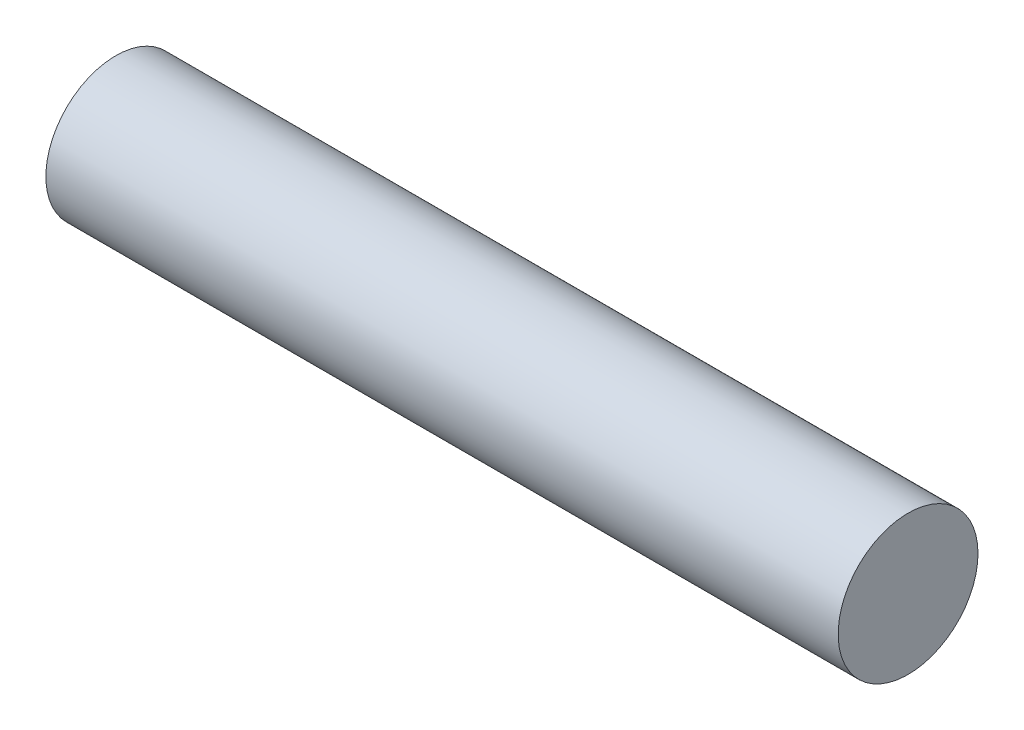
ISO-10303-21;
HEADER;
FILE_DESCRIPTION(('STEP AP214'),'2;1');
FILE_NAME('part.step','',(''),(''),'','','');
FILE_SCHEMA(('AUTOMOTIVE_DESIGN { 1 0 10303 214 1 1 1 1 }'));
ENDSEC;
DATA;
#1=APPLICATION_CONTEXT('core data for automotive mechanical design processes');
#2=APPLICATION_PROTOCOL_DEFINITION('international standard','automotive_design',2000,#1);
#3=PRODUCT_CONTEXT('',#1,'mechanical');
#4=PRODUCT('Part','Part','',(#3));
#5=PRODUCT_RELATED_PRODUCT_CATEGORY('part','',(#4));
#6=PRODUCT_DEFINITION_FORMATION('','',#4);
#7=PRODUCT_DEFINITION_CONTEXT('part definition',#1,'design');
#8=PRODUCT_DEFINITION('design','',#6,#7);
#9=PRODUCT_DEFINITION_SHAPE('','',#8);
#10=(LENGTH_UNIT() NAMED_UNIT(*) SI_UNIT(.MILLI.,.METRE.));
#11=(NAMED_UNIT(*) PLANE_ANGLE_UNIT() SI_UNIT($,.RADIAN.));
#12=(NAMED_UNIT(*) SI_UNIT($,.STERADIAN.) SOLID_ANGLE_UNIT());
#13=UNCERTAINTY_MEASURE_WITH_UNIT(LENGTH_MEASURE(1.E-05),#10,'distance_accuracy_value','');
#14=(GEOMETRIC_REPRESENTATION_CONTEXT(3) GLOBAL_UNCERTAINTY_ASSIGNED_CONTEXT((#13)) GLOBAL_UNIT_ASSIGNED_CONTEXT((#10,
#11,#12)) REPRESENTATION_CONTEXT('',''));
#15=CARTESIAN_POINT('',(0.,0.,0.));
#16=DIRECTION('',(0.,0.,1.));
#17=DIRECTION('',(1.,0.,0.));
#18=AXIS2_PLACEMENT_3D('',#15,#16,#17);
#19=CARTESIAN_POINT('',(107.95,0.,0.));
#20=DIRECTION('',(-1.,0.,0.));
#21=DIRECTION('',(0.,0.,1.));
#22=AXIS2_PLACEMENT_3D('',#19,#20,#21);
#23=CYLINDRICAL_SURFACE('',#22,19.05);
#24=CARTESIAN_POINT('',(107.95,0.,0.));
#25=DIRECTION('',(1.,0.,0.));
#26=DIRECTION('',(0.,0.,-1.));
#27=AXIS2_PLACEMENT_3D('',#24,#25,#26);
#28=CIRCLE('',#27,19.05);
#29=CARTESIAN_POINT('',(107.95,0.,-19.05));
#30=VERTEX_POINT('',#29);
#31=EDGE_CURVE('E10',#30,#30,#28,.T.);
#32=ORIENTED_EDGE('',*,*,#31,.F.);
#33=EDGE_LOOP('',(#32));
#34=FACE_BOUND('',#33,.T.);
#35=CARTESIAN_POINT('',(-107.95,0.,0.));
#36=DIRECTION('',(1.,0.,0.));
#37=DIRECTION('',(0.,0.,-1.));
#38=AXIS2_PLACEMENT_3D('',#35,#36,#37);
#39=CIRCLE('',#38,19.05);
#40=CARTESIAN_POINT('',(-107.95,0.,-19.05));
#41=VERTEX_POINT('',#40);
#42=EDGE_CURVE('E33',#41,#41,#39,.T.);
#43=ORIENTED_EDGE('',*,*,#42,.T.);
#44=EDGE_LOOP('',(#43));
#45=FACE_BOUND('',#44,.T.);
#46=ADVANCED_FACE('F30',(#34,#45),#23,.T.);
#47=CARTESIAN_POINT('',(107.95,0.,0.));
#48=DIRECTION('',(1.,0.,0.));
#49=DIRECTION('',(0.,0.,-1.));
#50=AXIS2_PLACEMENT_3D('',#47,#48,#49);
#51=PLANE('',#50);
#52=ORIENTED_EDGE('',*,*,#31,.T.);
#53=EDGE_LOOP('',(#52));
#54=FACE_BOUND('',#53,.T.);
#55=ADVANCED_FACE('F45',(#54),#51,.T.);
#56=CARTESIAN_POINT('',(-107.95,0.,0.));
#57=DIRECTION('',(1.,0.,0.));
#58=DIRECTION('',(0.,0.,-1.));
#59=AXIS2_PLACEMENT_3D('',#56,#57,#58);
#60=PLANE('',#59);
#61=ORIENTED_EDGE('',*,*,#42,.F.);
#62=EDGE_LOOP('',(#61));
#63=FACE_BOUND('',#62,.T.);
#64=ADVANCED_FACE('F43',(#63),#60,.F.);
#65=CLOSED_SHELL('',(#46,#55,#64));
#66=MANIFOLD_SOLID_BREP('B2',#65);
#67=ADVANCED_BREP_SHAPE_REPRESENTATION('',(#18,#66),#14);
#68=SHAPE_DEFINITION_REPRESENTATION(#9,#67);
ENDSEC;
END-ISO-10303-21;
